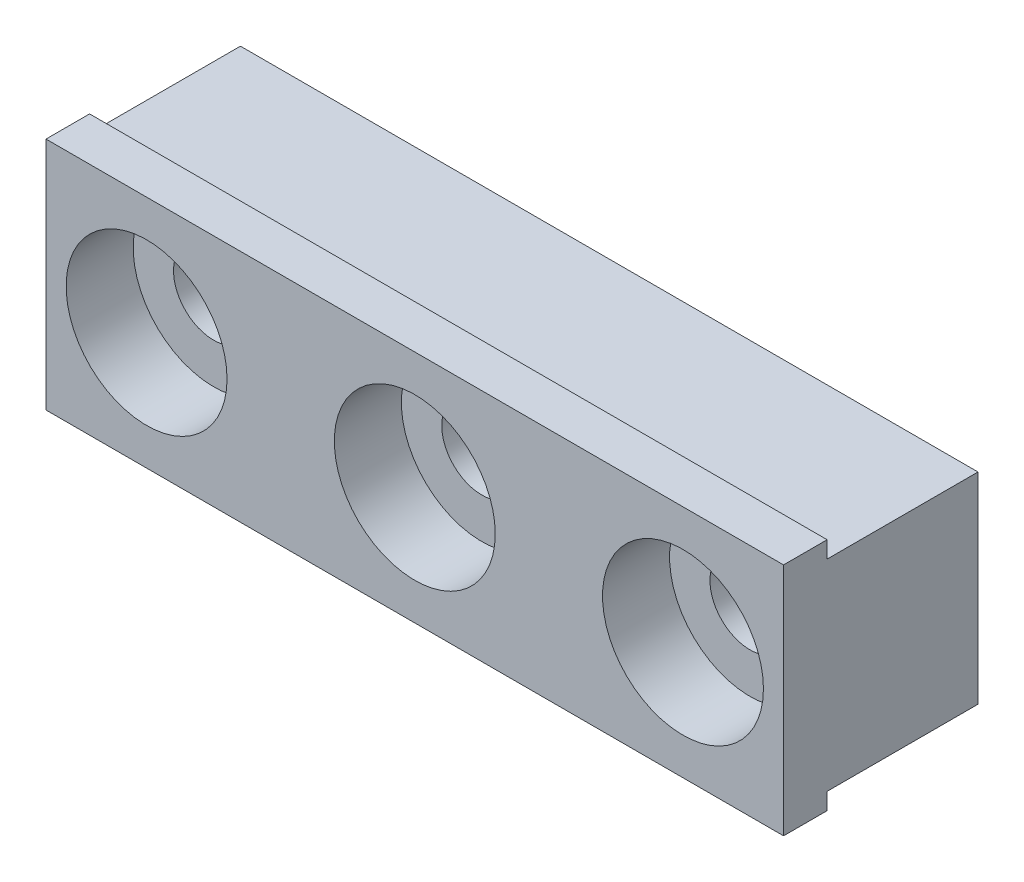
ISO-10303-21;
HEADER;
FILE_DESCRIPTION(('STEP AP214'),'2;1');
FILE_NAME('part.step','',(''),(''),'','','');
FILE_SCHEMA(('AUTOMOTIVE_DESIGN { 1 0 10303 214 1 1 1 1 }'));
ENDSEC;
DATA;
#1=APPLICATION_CONTEXT('core data for automotive mechanical design processes');
#2=APPLICATION_PROTOCOL_DEFINITION('international standard','automotive_design',2000,#1);
#3=PRODUCT_CONTEXT('',#1,'mechanical');
#4=PRODUCT('Part','Part','',(#3));
#5=PRODUCT_RELATED_PRODUCT_CATEGORY('part','',(#4));
#6=PRODUCT_DEFINITION_FORMATION('','',#4);
#7=PRODUCT_DEFINITION_CONTEXT('part definition',#1,'design');
#8=PRODUCT_DEFINITION('design','',#6,#7);
#9=PRODUCT_DEFINITION_SHAPE('','',#8);
#10=(LENGTH_UNIT() NAMED_UNIT(*) SI_UNIT(.MILLI.,.METRE.));
#11=(NAMED_UNIT(*) PLANE_ANGLE_UNIT() SI_UNIT($,.RADIAN.));
#12=(NAMED_UNIT(*) SI_UNIT($,.STERADIAN.) SOLID_ANGLE_UNIT());
#13=UNCERTAINTY_MEASURE_WITH_UNIT(LENGTH_MEASURE(1.E-05),#10,'distance_accuracy_value','');
#14=(GEOMETRIC_REPRESENTATION_CONTEXT(3) GLOBAL_UNCERTAINTY_ASSIGNED_CONTEXT((#13)) GLOBAL_UNIT_ASSIGNED_CONTEXT((#10,
#11,#12)) REPRESENTATION_CONTEXT('',''));
#15=CARTESIAN_POINT('',(0.,0.,0.));
#16=DIRECTION('',(0.,0.,1.));
#17=DIRECTION('',(1.,0.,0.));
#18=AXIS2_PLACEMENT_3D('',#15,#16,#17);
#19=CARTESIAN_POINT('',(30.1625,4.7625,9.2075));
#20=DIRECTION('',(0.,0.,1.));
#21=DIRECTION('',(1.,0.,0.));
#22=AXIS2_PLACEMENT_3D('',#19,#20,#21);
#23=CYLINDRICAL_SURFACE('',#22,1.89865);
#24=CARTESIAN_POINT('',(30.1625,4.7625,0.));
#25=DIRECTION('',(0.,0.,-1.));
#26=DIRECTION('',(-1.,0.,0.));
#27=AXIS2_PLACEMENT_3D('',#24,#25,#26);
#28=CIRCLE('',#27,1.89865);
#29=CARTESIAN_POINT('',(28.26385,4.7625,0.));
#30=VERTEX_POINT('',#29);
#31=EDGE_CURVE('E173',#30,#30,#28,.T.);
#32=ORIENTED_EDGE('',*,*,#31,.T.);
#33=EDGE_LOOP('',(#32));
#34=FACE_BOUND('',#33,.T.);
#35=CARTESIAN_POINT('',(30.1625,4.7625,6.0325));
#36=DIRECTION('',(0.,0.,1.));
#37=DIRECTION('',(1.,0.,0.));
#38=AXIS2_PLACEMENT_3D('',#35,#36,#37);
#39=CIRCLE('',#38,1.89865);
#40=CARTESIAN_POINT('',(32.06115,4.7625,6.0325));
#41=VERTEX_POINT('',#40);
#42=EDGE_CURVE('E42',#41,#41,#39,.F.);
#43=ORIENTED_EDGE('',*,*,#42,.F.);
#44=EDGE_LOOP('',(#43));
#45=FACE_BOUND('',#44,.T.);
#46=ADVANCED_FACE('F38',(#34,#45),#23,.F.);
#47=CARTESIAN_POINT('',(17.4625,4.7625,9.2075));
#48=DIRECTION('',(0.,0.,1.));
#49=DIRECTION('',(1.,0.,0.));
#50=AXIS2_PLACEMENT_3D('',#47,#48,#49);
#51=CYLINDRICAL_SURFACE('',#50,1.89865);
#52=CARTESIAN_POINT('',(17.4625,4.7625,0.));
#53=DIRECTION('',(0.,0.,-1.));
#54=DIRECTION('',(-1.,0.,0.));
#55=AXIS2_PLACEMENT_3D('',#52,#53,#54);
#56=CIRCLE('',#55,1.89865);
#57=CARTESIAN_POINT('',(15.56385,4.7625,0.));
#58=VERTEX_POINT('',#57);
#59=EDGE_CURVE('E168',#58,#58,#56,.T.);
#60=ORIENTED_EDGE('',*,*,#59,.T.);
#61=EDGE_LOOP('',(#60));
#62=FACE_BOUND('',#61,.T.);
#63=CARTESIAN_POINT('',(17.4625,4.7625,6.0325));
#64=DIRECTION('',(0.,0.,1.));
#65=DIRECTION('',(1.,0.,0.));
#66=AXIS2_PLACEMENT_3D('',#63,#64,#65);
#67=CIRCLE('',#66,1.89865);
#68=CARTESIAN_POINT('',(19.36115,4.7625,6.0325));
#69=VERTEX_POINT('',#68);
#70=EDGE_CURVE('E158',#69,#69,#67,.F.);
#71=ORIENTED_EDGE('',*,*,#70,.F.);
#72=EDGE_LOOP('',(#71));
#73=FACE_BOUND('',#72,.T.);
#74=ADVANCED_FACE('F220',(#62,#73),#51,.F.);
#75=CARTESIAN_POINT('',(4.7625,4.7625,9.2075));
#76=DIRECTION('',(0.,0.,1.));
#77=DIRECTION('',(1.,0.,0.));
#78=AXIS2_PLACEMENT_3D('',#75,#76,#77);
#79=CYLINDRICAL_SURFACE('',#78,1.89865);
#80=CARTESIAN_POINT('',(4.7625,4.7625,0.));
#81=DIRECTION('',(0.,0.,-1.));
#82=DIRECTION('',(-1.,0.,0.));
#83=AXIS2_PLACEMENT_3D('',#80,#81,#82);
#84=CIRCLE('',#83,1.89865);
#85=CARTESIAN_POINT('',(2.86385,4.7625,0.));
#86=VERTEX_POINT('',#85);
#87=EDGE_CURVE('E164',#86,#86,#84,.T.);
#88=ORIENTED_EDGE('',*,*,#87,.T.);
#89=EDGE_LOOP('',(#88));
#90=FACE_BOUND('',#89,.T.);
#91=CARTESIAN_POINT('',(4.7625,4.7625,6.0325));
#92=DIRECTION('',(0.,0.,1.));
#93=DIRECTION('',(1.,0.,0.));
#94=AXIS2_PLACEMENT_3D('',#91,#92,#93);
#95=CIRCLE('',#94,1.89865);
#96=CARTESIAN_POINT('',(6.66115,4.7625,6.0325));
#97=VERTEX_POINT('',#96);
#98=EDGE_CURVE('E156',#97,#97,#95,.F.);
#99=ORIENTED_EDGE('',*,*,#98,.F.);
#100=EDGE_LOOP('',(#99));
#101=FACE_BOUND('',#100,.T.);
#102=ADVANCED_FACE('F226',(#90,#101),#79,.F.);
#103=CARTESIAN_POINT('',(0.,0.,7.14375));
#104=DIRECTION('',(1.,0.,0.));
#105=DIRECTION('',(0.,0.,-1.));
#106=AXIS2_PLACEMENT_3D('',#103,#104,#105);
#107=PLANE('',#106);
#108=DIRECTION('',(0.,-1.,0.));
#109=VECTOR('',#108,1.);
#110=CARTESIAN_POINT('',(0.,0.,0.));
#111=LINE('',#110,#109);
#112=CARTESIAN_POINT('',(0.,9.525,0.));
#113=VERTEX_POINT('',#112);
#114=CARTESIAN_POINT('',(0.,0.,0.));
#115=VERTEX_POINT('',#114);
#116=EDGE_CURVE('E137',#113,#115,#111,.T.);
#117=ORIENTED_EDGE('',*,*,#116,.T.);
#118=DIRECTION('',(0.,0.,-1.));
#119=VECTOR('',#118,1.);
#120=CARTESIAN_POINT('',(0.,0.,7.14375));
#121=LINE('',#120,#119);
#122=CARTESIAN_POINT('',(0.,0.,7.14375));
#123=VERTEX_POINT('',#122);
#124=EDGE_CURVE('E12',#123,#115,#121,.T.);
#125=ORIENTED_EDGE('',*,*,#124,.F.);
#126=DIRECTION('',(0.,-1.,0.));
#127=VECTOR('',#126,1.);
#128=CARTESIAN_POINT('',(0.,10.31875,7.14375));
#129=LINE('',#128,#127);
#130=CARTESIAN_POINT('',(0.,-0.793749999999999,7.14375));
#131=VERTEX_POINT('',#130);
#132=EDGE_CURVE('E135',#123,#131,#129,.T.);
#133=ORIENTED_EDGE('',*,*,#132,.T.);
#134=DIRECTION('',(0.,0.,-1.));
#135=VECTOR('',#134,1.);
#136=CARTESIAN_POINT('',(0.,-0.793749999999999,9.2075));
#137=LINE('',#136,#135);
#138=CARTESIAN_POINT('',(0.,-0.793749999999999,9.2075));
#139=VERTEX_POINT('',#138);
#140=EDGE_CURVE('E116',#139,#131,#137,.T.);
#141=ORIENTED_EDGE('',*,*,#140,.F.);
#142=DIRECTION('',(0.,-1.,0.));
#143=VECTOR('',#142,1.);
#144=CARTESIAN_POINT('',(0.,10.31875,9.2075));
#145=LINE('',#144,#143);
#146=CARTESIAN_POINT('',(0.,10.31875,9.2075));
#147=VERTEX_POINT('',#146);
#148=EDGE_CURVE('E122',#147,#139,#145,.T.);
#149=ORIENTED_EDGE('',*,*,#148,.F.);
#150=DIRECTION('',(0.,0.,-1.));
#151=VECTOR('',#150,1.);
#152=CARTESIAN_POINT('',(0.,10.31875,9.2075));
#153=LINE('',#152,#151);
#154=CARTESIAN_POINT('',(0.,10.31875,7.14375));
#155=VERTEX_POINT('',#154);
#156=EDGE_CURVE('E183',#147,#155,#153,.T.);
#157=ORIENTED_EDGE('',*,*,#156,.T.);
#158=CARTESIAN_POINT('',(0.,9.525,7.14375));
#159=VERTEX_POINT('',#158);
#160=EDGE_CURVE('E184',#155,#159,#129,.T.);
#161=ORIENTED_EDGE('',*,*,#160,.T.);
#162=DIRECTION('',(0.,0.,-1.));
#163=VECTOR('',#162,1.);
#164=CARTESIAN_POINT('',(0.,9.525,7.14375));
#165=LINE('',#164,#163);
#166=EDGE_CURVE('E148',#159,#113,#165,.T.);
#167=ORIENTED_EDGE('',*,*,#166,.T.);
#168=EDGE_LOOP('',(#117,#125,#133,#141,#149,#157,#161,#167));
#169=FACE_BOUND('',#168,.T.);
#170=ADVANCED_FACE('F40',(#169),#107,.F.);
#171=CARTESIAN_POINT('',(0.,0.,7.14375));
#172=DIRECTION('',(0.,1.,0.));
#173=DIRECTION('',(0.,0.,1.));
#174=AXIS2_PLACEMENT_3D('',#171,#172,#173);
#175=PLANE('',#174);
#176=DIRECTION('',(1.,0.,0.));
#177=VECTOR('',#176,1.);
#178=CARTESIAN_POINT('',(0.,0.,0.));
#179=LINE('',#178,#177);
#180=CARTESIAN_POINT('',(34.925,0.,0.));
#181=VERTEX_POINT('',#180);
#182=EDGE_CURVE('E139',#115,#181,#179,.T.);
#183=ORIENTED_EDGE('',*,*,#182,.T.);
#184=DIRECTION('',(0.,0.,-1.));
#185=VECTOR('',#184,1.);
#186=CARTESIAN_POINT('',(34.925,0.,7.14375));
#187=LINE('',#186,#185);
#188=CARTESIAN_POINT('',(34.925,0.,7.14375));
#189=VERTEX_POINT('',#188);
#190=EDGE_CURVE('E48',#189,#181,#187,.T.);
#191=ORIENTED_EDGE('',*,*,#190,.F.);
#192=DIRECTION('',(1.,0.,0.));
#193=VECTOR('',#192,1.);
#194=CARTESIAN_POINT('',(0.,0.,7.14375));
#195=LINE('',#194,#193);
#196=EDGE_CURVE('E83',#123,#189,#195,.T.);
#197=ORIENTED_EDGE('',*,*,#196,.F.);
#198=ORIENTED_EDGE('',*,*,#124,.T.);
#199=EDGE_LOOP('',(#183,#191,#197,#198));
#200=FACE_BOUND('',#199,.T.);
#201=ADVANCED_FACE('F206',(#200),#175,.F.);
#202=CARTESIAN_POINT('',(34.925,0.,7.14375));
#203=DIRECTION('',(-1.,0.,0.));
#204=DIRECTION('',(0.,0.,1.));
#205=AXIS2_PLACEMENT_3D('',#202,#203,#204);
#206=PLANE('',#205);
#207=DIRECTION('',(0.,1.,0.));
#208=VECTOR('',#207,1.);
#209=CARTESIAN_POINT('',(34.925,0.,0.));
#210=LINE('',#209,#208);
#211=CARTESIAN_POINT('',(34.925,9.525,0.));
#212=VERTEX_POINT('',#211);
#213=EDGE_CURVE('E73',#181,#212,#210,.T.);
#214=ORIENTED_EDGE('',*,*,#213,.T.);
#215=DIRECTION('',(0.,0.,-1.));
#216=VECTOR('',#215,1.);
#217=CARTESIAN_POINT('',(34.925,9.525,7.14375));
#218=LINE('',#217,#216);
#219=CARTESIAN_POINT('',(34.925,9.525,7.14375));
#220=VERTEX_POINT('',#219);
#221=EDGE_CURVE('E57',#220,#212,#218,.T.);
#222=ORIENTED_EDGE('',*,*,#221,.F.);
#223=DIRECTION('',(0.,1.,0.));
#224=VECTOR('',#223,1.);
#225=CARTESIAN_POINT('',(34.925,10.31875,7.14375));
#226=LINE('',#225,#224);
#227=CARTESIAN_POINT('',(34.925,10.31875,7.14375));
#228=VERTEX_POINT('',#227);
#229=EDGE_CURVE('E189',#220,#228,#226,.T.);
#230=ORIENTED_EDGE('',*,*,#229,.T.);
#231=DIRECTION('',(0.,0.,-1.));
#232=VECTOR('',#231,1.);
#233=CARTESIAN_POINT('',(34.925,10.31875,9.2075));
#234=LINE('',#233,#232);
#235=CARTESIAN_POINT('',(34.925,10.31875,9.2075));
#236=VERTEX_POINT('',#235);
#237=EDGE_CURVE('E141',#236,#228,#234,.T.);
#238=ORIENTED_EDGE('',*,*,#237,.F.);
#239=DIRECTION('',(0.,1.,0.));
#240=VECTOR('',#239,1.);
#241=CARTESIAN_POINT('',(34.925,10.31875,9.2075));
#242=LINE('',#241,#240);
#243=CARTESIAN_POINT('',(34.925,-0.793749999999999,9.2075));
#244=VERTEX_POINT('',#243);
#245=EDGE_CURVE('E121',#244,#236,#242,.T.);
#246=ORIENTED_EDGE('',*,*,#245,.F.);
#247=DIRECTION('',(0.,0.,-1.));
#248=VECTOR('',#247,1.);
#249=CARTESIAN_POINT('',(34.925,-0.793749999999999,9.2075));
#250=LINE('',#249,#248);
#251=CARTESIAN_POINT('',(34.925,-0.793749999999999,7.14375));
#252=VERTEX_POINT('',#251);
#253=EDGE_CURVE('E118',#244,#252,#250,.T.);
#254=ORIENTED_EDGE('',*,*,#253,.T.);
#255=EDGE_CURVE('E190',#252,#189,#226,.T.);
#256=ORIENTED_EDGE('',*,*,#255,.T.);
#257=ORIENTED_EDGE('',*,*,#190,.T.);
#258=EDGE_LOOP('',(#214,#222,#230,#238,#246,#254,#256,#257));
#259=FACE_BOUND('',#258,.T.);
#260=ADVANCED_FACE('F210',(#259),#206,.F.);
#261=CARTESIAN_POINT('',(0.,9.525,7.14375));
#262=DIRECTION('',(0.,-1.,0.));
#263=DIRECTION('',(0.,0.,-1.));
#264=AXIS2_PLACEMENT_3D('',#261,#262,#263);
#265=PLANE('',#264);
#266=DIRECTION('',(-1.,0.,0.));
#267=VECTOR('',#266,1.);
#268=CARTESIAN_POINT('',(0.,9.525,0.));
#269=LINE('',#268,#267);
#270=EDGE_CURVE('E78',#212,#113,#269,.T.);
#271=ORIENTED_EDGE('',*,*,#270,.T.);
#272=ORIENTED_EDGE('',*,*,#166,.F.);
#273=DIRECTION('',(-1.,0.,0.));
#274=VECTOR('',#273,1.);
#275=CARTESIAN_POINT('',(0.,9.525,7.14375));
#276=LINE('',#275,#274);
#277=EDGE_CURVE('E146',#220,#159,#276,.T.);
#278=ORIENTED_EDGE('',*,*,#277,.F.);
#279=ORIENTED_EDGE('',*,*,#221,.T.);
#280=EDGE_LOOP('',(#271,#272,#278,#279));
#281=FACE_BOUND('',#280,.T.);
#282=ADVANCED_FACE('F212',(#281),#265,.F.);
#283=CARTESIAN_POINT('',(0.,0.,0.));
#284=DIRECTION('',(0.,0.,-1.));
#285=DIRECTION('',(-1.,0.,0.));
#286=AXIS2_PLACEMENT_3D('',#283,#284,#285);
#287=PLANE('',#286);
#288=ORIENTED_EDGE('',*,*,#87,.F.);
#289=EDGE_LOOP('',(#288));
#290=FACE_BOUND('',#289,.T.);
#291=ORIENTED_EDGE('',*,*,#59,.F.);
#292=EDGE_LOOP('',(#291));
#293=FACE_BOUND('',#292,.T.);
#294=ORIENTED_EDGE('',*,*,#31,.F.);
#295=EDGE_LOOP('',(#294));
#296=FACE_BOUND('',#295,.T.);
#297=ORIENTED_EDGE('',*,*,#116,.F.);
#298=ORIENTED_EDGE('',*,*,#270,.F.);
#299=ORIENTED_EDGE('',*,*,#213,.F.);
#300=ORIENTED_EDGE('',*,*,#182,.F.);
#301=EDGE_LOOP('',(#297,#298,#299,#300));
#302=FACE_BOUND('',#301,.T.);
#303=ADVANCED_FACE('F205',(#290,#293,#296,#302),#287,.T.);
#304=CARTESIAN_POINT('',(0.,0.,7.14375));
#305=DIRECTION('',(0.,0.,1.));
#306=DIRECTION('',(1.,0.,0.));
#307=AXIS2_PLACEMENT_3D('',#304,#305,#306);
#308=PLANE('',#307);
#309=ORIENTED_EDGE('',*,*,#132,.F.);
#310=ORIENTED_EDGE('',*,*,#196,.T.);
#311=ORIENTED_EDGE('',*,*,#255,.F.);
#312=DIRECTION('',(1.,0.,0.));
#313=VECTOR('',#312,1.);
#314=CARTESIAN_POINT('',(0.,-0.793749999999999,7.14375));
#315=LINE('',#314,#313);
#316=EDGE_CURVE('E187',#131,#252,#315,.T.);
#317=ORIENTED_EDGE('',*,*,#316,.F.);
#318=EDGE_LOOP('',(#309,#310,#311,#317));
#319=FACE_BOUND('',#318,.T.);
#320=ADVANCED_FACE('F208',(#319),#308,.F.);
#321=ORIENTED_EDGE('',*,*,#229,.F.);
#322=ORIENTED_EDGE('',*,*,#277,.T.);
#323=ORIENTED_EDGE('',*,*,#160,.F.);
#324=DIRECTION('',(-1.,0.,0.));
#325=VECTOR('',#324,1.);
#326=CARTESIAN_POINT('',(0.,10.31875,7.14375));
#327=LINE('',#326,#325);
#328=EDGE_CURVE('E131',#228,#155,#327,.T.);
#329=ORIENTED_EDGE('',*,*,#328,.F.);
#330=EDGE_LOOP('',(#321,#322,#323,#329));
#331=FACE_BOUND('',#330,.T.);
#332=ADVANCED_FACE('F202',(#331),#308,.F.);
#333=CARTESIAN_POINT('',(0.,-0.793749999999999,9.2075));
#334=DIRECTION('',(0.,1.,0.));
#335=DIRECTION('',(0.,0.,1.));
#336=AXIS2_PLACEMENT_3D('',#333,#334,#335);
#337=PLANE('',#336);
#338=ORIENTED_EDGE('',*,*,#316,.T.);
#339=ORIENTED_EDGE('',*,*,#253,.F.);
#340=DIRECTION('',(1.,0.,0.));
#341=VECTOR('',#340,1.);
#342=CARTESIAN_POINT('',(0.,-0.793749999999999,9.2075));
#343=LINE('',#342,#341);
#344=EDGE_CURVE('E112',#139,#244,#343,.T.);
#345=ORIENTED_EDGE('',*,*,#344,.F.);
#346=ORIENTED_EDGE('',*,*,#140,.T.);
#347=EDGE_LOOP('',(#338,#339,#345,#346));
#348=FACE_BOUND('',#347,.T.);
#349=ADVANCED_FACE('F114',(#348),#337,.F.);
#350=CARTESIAN_POINT('',(0.,10.31875,9.2075));
#351=DIRECTION('',(0.,-1.,0.));
#352=DIRECTION('',(0.,0.,-1.));
#353=AXIS2_PLACEMENT_3D('',#350,#351,#352);
#354=PLANE('',#353);
#355=ORIENTED_EDGE('',*,*,#328,.T.);
#356=ORIENTED_EDGE('',*,*,#156,.F.);
#357=DIRECTION('',(-1.,0.,0.));
#358=VECTOR('',#357,1.);
#359=CARTESIAN_POINT('',(0.,10.31875,9.2075));
#360=LINE('',#359,#358);
#361=EDGE_CURVE('E127',#236,#147,#360,.T.);
#362=ORIENTED_EDGE('',*,*,#361,.F.);
#363=ORIENTED_EDGE('',*,*,#237,.T.);
#364=EDGE_LOOP('',(#355,#356,#362,#363));
#365=FACE_BOUND('',#364,.T.);
#366=ADVANCED_FACE('F198',(#365),#354,.F.);
#367=CARTESIAN_POINT('',(0.,0.,9.2075));
#368=DIRECTION('',(0.,0.,1.));
#369=DIRECTION('',(1.,0.,0.));
#370=AXIS2_PLACEMENT_3D('',#367,#368,#369);
#371=PLANE('',#370);
#372=CARTESIAN_POINT('',(4.7625,4.7625,9.2075));
#373=DIRECTION('',(0.,0.,1.));
#374=DIRECTION('',(1.,0.,0.));
#375=AXIS2_PLACEMENT_3D('',#372,#373,#374);
#376=CIRCLE('',#375,3.81);
#377=CARTESIAN_POINT('',(8.5725,4.7625,9.2075));
#378=VERTEX_POINT('',#377);
#379=EDGE_CURVE('E408',#378,#378,#376,.T.);
#380=ORIENTED_EDGE('',*,*,#379,.F.);
#381=EDGE_LOOP('',(#380));
#382=FACE_BOUND('',#381,.T.);
#383=CARTESIAN_POINT('',(17.4625,4.7625,9.2075));
#384=DIRECTION('',(0.,0.,1.));
#385=DIRECTION('',(1.,0.,0.));
#386=AXIS2_PLACEMENT_3D('',#383,#384,#385);
#387=CIRCLE('',#386,3.81);
#388=CARTESIAN_POINT('',(21.2725,4.7625,9.2075));
#389=VERTEX_POINT('',#388);
#390=EDGE_CURVE('E401',#389,#389,#387,.T.);
#391=ORIENTED_EDGE('',*,*,#390,.F.);
#392=EDGE_LOOP('',(#391));
#393=FACE_BOUND('',#392,.T.);
#394=CARTESIAN_POINT('',(30.1625,4.7625,9.2075));
#395=DIRECTION('',(0.,0.,1.));
#396=DIRECTION('',(1.,0.,0.));
#397=AXIS2_PLACEMENT_3D('',#394,#395,#396);
#398=CIRCLE('',#397,3.81);
#399=CARTESIAN_POINT('',(33.9725,4.7625,9.2075));
#400=VERTEX_POINT('',#399);
#401=EDGE_CURVE('E176',#400,#400,#398,.T.);
#402=ORIENTED_EDGE('',*,*,#401,.F.);
#403=EDGE_LOOP('',(#402));
#404=FACE_BOUND('',#403,.T.);
#405=ORIENTED_EDGE('',*,*,#148,.T.);
#406=ORIENTED_EDGE('',*,*,#344,.T.);
#407=ORIENTED_EDGE('',*,*,#245,.T.);
#408=ORIENTED_EDGE('',*,*,#361,.T.);
#409=EDGE_LOOP('',(#405,#406,#407,#408));
#410=FACE_BOUND('',#409,.T.);
#411=ADVANCED_FACE('F125',(#382,#393,#404,#410),#371,.T.);
#412=CARTESIAN_POINT('',(4.7625,4.7625,6.0325));
#413=DIRECTION('',(0.,0.,1.));
#414=DIRECTION('',(1.,0.,0.));
#415=AXIS2_PLACEMENT_3D('',#412,#413,#414);
#416=PLANE('',#415);
#417=CARTESIAN_POINT('',(4.7625,4.7625,6.0325));
#418=DIRECTION('',(0.,0.,1.));
#419=DIRECTION('',(1.,0.,0.));
#420=AXIS2_PLACEMENT_3D('',#417,#418,#419);
#421=CIRCLE('',#420,3.81);
#422=CARTESIAN_POINT('',(8.5725,4.7625,6.0325));
#423=VERTEX_POINT('',#422);
#424=EDGE_CURVE('E159',#423,#423,#421,.T.);
#425=ORIENTED_EDGE('',*,*,#424,.T.);
#426=EDGE_LOOP('',(#425));
#427=FACE_BOUND('',#426,.T.);
#428=ORIENTED_EDGE('',*,*,#98,.T.);
#429=EDGE_LOOP('',(#428));
#430=FACE_BOUND('',#429,.T.);
#431=ADVANCED_FACE('F234',(#427,#430),#416,.T.);
#432=CARTESIAN_POINT('',(4.7625,4.7625,6.0325));
#433=DIRECTION('',(0.,0.,1.));
#434=DIRECTION('',(1.,0.,0.));
#435=AXIS2_PLACEMENT_3D('',#432,#433,#434);
#436=CYLINDRICAL_SURFACE('',#435,3.81);
#437=ORIENTED_EDGE('',*,*,#424,.F.);
#438=EDGE_LOOP('',(#437));
#439=FACE_BOUND('',#438,.T.);
#440=ORIENTED_EDGE('',*,*,#379,.T.);
#441=EDGE_LOOP('',(#440));
#442=FACE_BOUND('',#441,.T.);
#443=ADVANCED_FACE('F281',(#439,#442),#436,.F.);
#444=CARTESIAN_POINT('',(17.4625,4.7625,6.0325));
#445=DIRECTION('',(0.,0.,1.));
#446=DIRECTION('',(1.,0.,0.));
#447=AXIS2_PLACEMENT_3D('',#444,#445,#446);
#448=PLANE('',#447);
#449=CARTESIAN_POINT('',(17.4625,4.7625,6.0325));
#450=DIRECTION('',(0.,0.,1.));
#451=DIRECTION('',(1.,0.,0.));
#452=AXIS2_PLACEMENT_3D('',#449,#450,#451);
#453=CIRCLE('',#452,3.81);
#454=CARTESIAN_POINT('',(21.2725,4.7625,6.0325));
#455=VERTEX_POINT('',#454);
#456=EDGE_CURVE('E403',#455,#455,#453,.T.);
#457=ORIENTED_EDGE('',*,*,#456,.T.);
#458=EDGE_LOOP('',(#457));
#459=FACE_BOUND('',#458,.T.);
#460=ORIENTED_EDGE('',*,*,#70,.T.);
#461=EDGE_LOOP('',(#460));
#462=FACE_BOUND('',#461,.T.);
#463=ADVANCED_FACE('F289',(#459,#462),#448,.T.);
#464=CARTESIAN_POINT('',(17.4625,4.7625,6.0325));
#465=DIRECTION('',(0.,0.,1.));
#466=DIRECTION('',(1.,0.,0.));
#467=AXIS2_PLACEMENT_3D('',#464,#465,#466);
#468=CYLINDRICAL_SURFACE('',#467,3.81);
#469=ORIENTED_EDGE('',*,*,#456,.F.);
#470=EDGE_LOOP('',(#469));
#471=FACE_BOUND('',#470,.T.);
#472=ORIENTED_EDGE('',*,*,#390,.T.);
#473=EDGE_LOOP('',(#472));
#474=FACE_BOUND('',#473,.T.);
#475=ADVANCED_FACE('F297',(#471,#474),#468,.F.);
#476=CARTESIAN_POINT('',(30.1625,4.7625,6.0325));
#477=DIRECTION('',(0.,0.,1.));
#478=DIRECTION('',(1.,0.,0.));
#479=AXIS2_PLACEMENT_3D('',#476,#477,#478);
#480=PLANE('',#479);
#481=CARTESIAN_POINT('',(30.1625,4.7625,6.0325));
#482=DIRECTION('',(0.,0.,1.));
#483=DIRECTION('',(1.,0.,0.));
#484=AXIS2_PLACEMENT_3D('',#481,#482,#483);
#485=CIRCLE('',#484,3.81);
#486=CARTESIAN_POINT('',(33.9725,4.7625,6.0325));
#487=VERTEX_POINT('',#486);
#488=EDGE_CURVE('E397',#487,#487,#485,.T.);
#489=ORIENTED_EDGE('',*,*,#488,.T.);
#490=EDGE_LOOP('',(#489));
#491=FACE_BOUND('',#490,.T.);
#492=ORIENTED_EDGE('',*,*,#42,.T.);
#493=EDGE_LOOP('',(#492));
#494=FACE_BOUND('',#493,.T.);
#495=ADVANCED_FACE('F305',(#491,#494),#480,.T.);
#496=CARTESIAN_POINT('',(30.1625,4.7625,6.0325));
#497=DIRECTION('',(0.,0.,1.));
#498=DIRECTION('',(1.,0.,0.));
#499=AXIS2_PLACEMENT_3D('',#496,#497,#498);
#500=CYLINDRICAL_SURFACE('',#499,3.81);
#501=ORIENTED_EDGE('',*,*,#488,.F.);
#502=EDGE_LOOP('',(#501));
#503=FACE_BOUND('',#502,.T.);
#504=ORIENTED_EDGE('',*,*,#401,.T.);
#505=EDGE_LOOP('',(#504));
#506=FACE_BOUND('',#505,.T.);
#507=ADVANCED_FACE('F313',(#503,#506),#500,.F.);
#508=CLOSED_SHELL('',(#46,#74,#102,#170,#201,#260,#282,#303,#320,#332,#349,#366,#411,#431,#443,
#463,#475,#495,#507));
#509=MANIFOLD_SOLID_BREP('B2',#508);
#510=ADVANCED_BREP_SHAPE_REPRESENTATION('',(#18,#509),#14);
#511=SHAPE_DEFINITION_REPRESENTATION(#9,#510);
ENDSEC;
END-ISO-10303-21;
